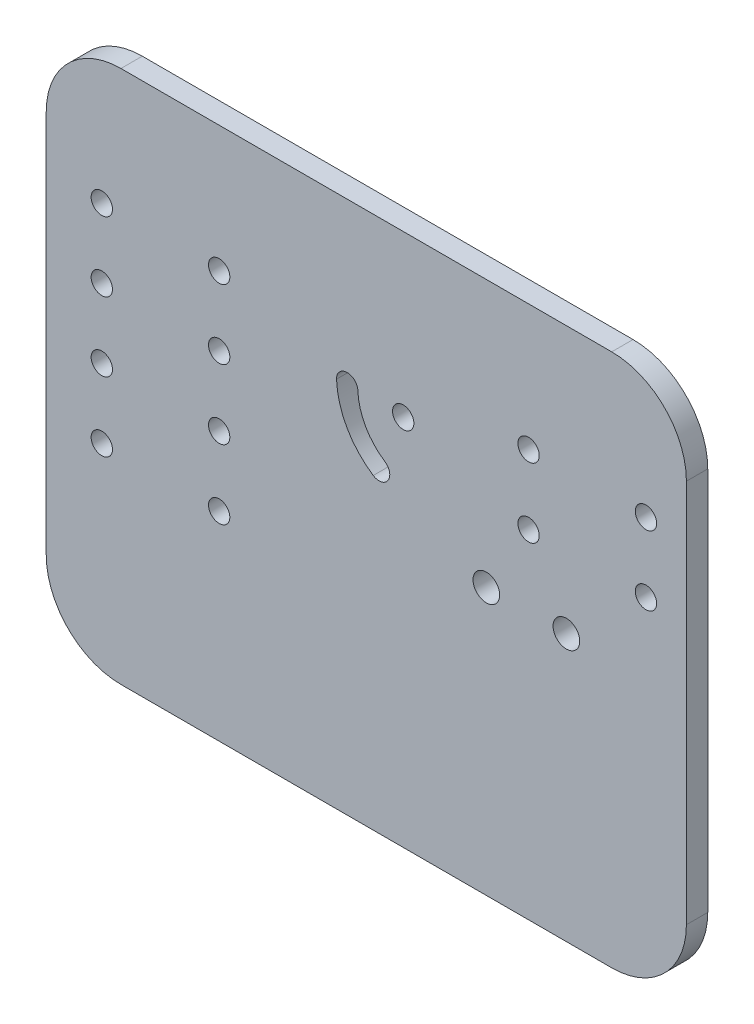
ISO-10303-21;
HEADER;
FILE_DESCRIPTION(('STEP AP214'),'2;1');
FILE_NAME('part.step','',(''),(''),'','','');
FILE_SCHEMA(('AUTOMOTIVE_DESIGN { 1 0 10303 214 1 1 1 1 }'));
ENDSEC;
DATA;
#1=APPLICATION_CONTEXT('core data for automotive mechanical design processes');
#2=APPLICATION_PROTOCOL_DEFINITION('international standard','automotive_design',2000,#1);
#3=PRODUCT_CONTEXT('',#1,'mechanical');
#4=PRODUCT('Part','Part','',(#3));
#5=PRODUCT_RELATED_PRODUCT_CATEGORY('part','',(#4));
#6=PRODUCT_DEFINITION_FORMATION('','',#4);
#7=PRODUCT_DEFINITION_CONTEXT('part definition',#1,'design');
#8=PRODUCT_DEFINITION('design','',#6,#7);
#9=PRODUCT_DEFINITION_SHAPE('','',#8);
#10=(LENGTH_UNIT() NAMED_UNIT(*) SI_UNIT(.MILLI.,.METRE.));
#11=(NAMED_UNIT(*) PLANE_ANGLE_UNIT() SI_UNIT($,.RADIAN.));
#12=(NAMED_UNIT(*) SI_UNIT($,.STERADIAN.) SOLID_ANGLE_UNIT());
#13=UNCERTAINTY_MEASURE_WITH_UNIT(LENGTH_MEASURE(1.E-05),#10,'distance_accuracy_value','');
#14=(GEOMETRIC_REPRESENTATION_CONTEXT(3) GLOBAL_UNCERTAINTY_ASSIGNED_CONTEXT((#13)) GLOBAL_UNIT_ASSIGNED_CONTEXT((#10,
#11,#12)) REPRESENTATION_CONTEXT('',''));
#15=CARTESIAN_POINT('',(0.,0.,0.));
#16=DIRECTION('',(0.,0.,1.));
#17=DIRECTION('',(1.,0.,0.));
#18=AXIS2_PLACEMENT_3D('',#15,#16,#17);
#19=CARTESIAN_POINT('',(-52.655601659751,38.8381742738589,4.));
#20=DIRECTION('',(1.,0.,0.));
#21=DIRECTION('',(0.,1.,0.));
#22=AXIS2_PLACEMENT_3D('',#19,#20,#21);
#23=PLANE('',#22);
#24=DIRECTION('',(0.,-1.,0.));
#25=VECTOR('',#24,1.);
#26=CARTESIAN_POINT('',(-52.655601659751,38.8381742738589,0.));
#27=LINE('',#26,#25);
#28=CARTESIAN_POINT('',(-52.655601659751,24.8381742738589,0.));
#29=VERTEX_POINT('',#28);
#30=CARTESIAN_POINT('',(-52.655601659751,-47.1618257261411,0.));
#31=VERTEX_POINT('',#30);
#32=EDGE_CURVE('E189',#29,#31,#27,.T.);
#33=ORIENTED_EDGE('',*,*,#32,.T.);
#34=DIRECTION('',(0.,0.,-1.));
#35=VECTOR('',#34,1.);
#36=CARTESIAN_POINT('',(-52.655601659751,-47.1618257261411,4.));
#37=LINE('',#36,#35);
#38=CARTESIAN_POINT('',(-52.655601659751,-47.1618257261411,4.));
#39=VERTEX_POINT('',#38);
#40=EDGE_CURVE('E11',#31,#39,#37,.F.);
#41=ORIENTED_EDGE('',*,*,#40,.T.);
#42=DIRECTION('',(0.,-1.,0.));
#43=VECTOR('',#42,1.);
#44=CARTESIAN_POINT('',(-52.655601659751,38.8381742738589,4.));
#45=LINE('',#44,#43);
#46=CARTESIAN_POINT('',(-52.655601659751,24.8381742738589,4.));
#47=VERTEX_POINT('',#46);
#48=EDGE_CURVE('E201',#47,#39,#45,.T.);
#49=ORIENTED_EDGE('',*,*,#48,.F.);
#50=DIRECTION('',(0.,0.,-1.));
#51=VECTOR('',#50,1.);
#52=CARTESIAN_POINT('',(-52.655601659751,24.8381742738589,4.));
#53=LINE('',#52,#51);
#54=EDGE_CURVE('E52',#47,#29,#53,.T.);
#55=ORIENTED_EDGE('',*,*,#54,.T.);
#56=EDGE_LOOP('',(#33,#41,#49,#55));
#57=FACE_BOUND('',#56,.T.);
#58=ADVANCED_FACE('F43',(#57),#23,.F.);
#59=CARTESIAN_POINT('',(-52.655601659751,-61.1618257261411,4.));
#60=DIRECTION('',(0.,1.,0.));
#61=DIRECTION('',(0.,0.,1.));
#62=AXIS2_PLACEMENT_3D('',#59,#60,#61);
#63=PLANE('',#62);
#64=DIRECTION('',(1.,0.,0.));
#65=VECTOR('',#64,1.);
#66=CARTESIAN_POINT('',(-52.655601659751,-61.1618257261411,0.));
#67=LINE('',#66,#65);
#68=CARTESIAN_POINT('',(-38.655601659751,-61.1618257261411,0.));
#69=VERTEX_POINT('',#68);
#70=CARTESIAN_POINT('',(53.3443983402489,-61.1618257261411,0.));
#71=VERTEX_POINT('',#70);
#72=EDGE_CURVE('E222',#69,#71,#67,.T.);
#73=ORIENTED_EDGE('',*,*,#72,.T.);
#74=DIRECTION('',(0.,0.,-1.));
#75=VECTOR('',#74,1.);
#76=CARTESIAN_POINT('',(53.344398340249,-61.1618257261411,4.));
#77=LINE('',#76,#75);
#78=CARTESIAN_POINT('',(53.3443983402489,-61.1618257261411,4.));
#79=VERTEX_POINT('',#78);
#80=EDGE_CURVE('E274',#71,#79,#77,.F.);
#81=ORIENTED_EDGE('',*,*,#80,.T.);
#82=DIRECTION('',(1.,0.,0.));
#83=VECTOR('',#82,1.);
#84=CARTESIAN_POINT('',(-52.655601659751,-61.1618257261411,4.));
#85=LINE('',#84,#83);
#86=CARTESIAN_POINT('',(-38.655601659751,-61.1618257261411,4.));
#87=VERTEX_POINT('',#86);
#88=EDGE_CURVE('E205',#87,#79,#85,.T.);
#89=ORIENTED_EDGE('',*,*,#88,.F.);
#90=DIRECTION('',(0.,0.,-1.));
#91=VECTOR('',#90,1.);
#92=CARTESIAN_POINT('',(-38.655601659751,-61.1618257261411,4.));
#93=LINE('',#92,#91);
#94=EDGE_CURVE('E270',#87,#69,#93,.T.);
#95=ORIENTED_EDGE('',*,*,#94,.T.);
#96=EDGE_LOOP('',(#73,#81,#89,#95));
#97=FACE_BOUND('',#96,.T.);
#98=ADVANCED_FACE('F295',(#97),#63,.F.);
#99=CARTESIAN_POINT('',(67.344398340249,38.8381742738589,4.));
#100=DIRECTION('',(-1.,0.,0.));
#101=DIRECTION('',(0.,0.,1.));
#102=AXIS2_PLACEMENT_3D('',#99,#100,#101);
#103=PLANE('',#102);
#104=DIRECTION('',(0.,1.,0.));
#105=VECTOR('',#104,1.);
#106=CARTESIAN_POINT('',(67.344398340249,38.8381742738589,0.));
#107=LINE('',#106,#105);
#108=CARTESIAN_POINT('',(67.344398340249,-47.1618257261411,0.));
#109=VERTEX_POINT('',#108);
#110=CARTESIAN_POINT('',(67.344398340249,24.8381742738589,0.));
#111=VERTEX_POINT('',#110);
#112=EDGE_CURVE('E226',#109,#111,#107,.T.);
#113=ORIENTED_EDGE('',*,*,#112,.T.);
#114=DIRECTION('',(0.,0.,-1.));
#115=VECTOR('',#114,1.);
#116=CARTESIAN_POINT('',(67.344398340249,24.8381742738589,4.));
#117=LINE('',#116,#115);
#118=CARTESIAN_POINT('',(67.344398340249,24.8381742738589,4.));
#119=VERTEX_POINT('',#118);
#120=EDGE_CURVE('E255',#111,#119,#117,.F.);
#121=ORIENTED_EDGE('',*,*,#120,.T.);
#122=DIRECTION('',(0.,1.,0.));
#123=VECTOR('',#122,1.);
#124=CARTESIAN_POINT('',(67.344398340249,38.8381742738589,4.));
#125=LINE('',#124,#123);
#126=CARTESIAN_POINT('',(67.344398340249,-47.1618257261411,4.));
#127=VERTEX_POINT('',#126);
#128=EDGE_CURVE('E210',#127,#119,#125,.T.);
#129=ORIENTED_EDGE('',*,*,#128,.F.);
#130=DIRECTION('',(0.,0.,-1.));
#131=VECTOR('',#130,1.);
#132=CARTESIAN_POINT('',(67.344398340249,-47.1618257261411,4.));
#133=LINE('',#132,#131);
#134=EDGE_CURVE('E251',#127,#109,#133,.T.);
#135=ORIENTED_EDGE('',*,*,#134,.T.);
#136=EDGE_LOOP('',(#113,#121,#129,#135));
#137=FACE_BOUND('',#136,.T.);
#138=ADVANCED_FACE('F305',(#137),#103,.F.);
#139=CARTESIAN_POINT('',(-52.655601659751,38.8381742738589,4.));
#140=DIRECTION('',(0.,-1.,0.));
#141=DIRECTION('',(0.,0.,-1.));
#142=AXIS2_PLACEMENT_3D('',#139,#140,#141);
#143=PLANE('',#142);
#144=DIRECTION('',(-1.,0.,0.));
#145=VECTOR('',#144,1.);
#146=CARTESIAN_POINT('',(-52.655601659751,38.8381742738589,4.));
#147=LINE('',#146,#145);
#148=CARTESIAN_POINT('',(53.344398340249,38.8381742738589,4.));
#149=VERTEX_POINT('',#148);
#150=CARTESIAN_POINT('',(-38.655601659751,38.8381742738589,4.));
#151=VERTEX_POINT('',#150);
#152=EDGE_CURVE('E214',#149,#151,#147,.T.);
#153=ORIENTED_EDGE('',*,*,#152,.F.);
#154=DIRECTION('',(0.,0.,-1.));
#155=VECTOR('',#154,1.);
#156=CARTESIAN_POINT('',(53.344398340249,38.8381742738589,4.));
#157=LINE('',#156,#155);
#158=CARTESIAN_POINT('',(53.344398340249,38.8381742738589,0.));
#159=VERTEX_POINT('',#158);
#160=EDGE_CURVE('E235',#149,#159,#157,.T.);
#161=ORIENTED_EDGE('',*,*,#160,.T.);
#162=DIRECTION('',(-1.,0.,0.));
#163=VECTOR('',#162,1.);
#164=CARTESIAN_POINT('',(-52.655601659751,38.8381742738589,0.));
#165=LINE('',#164,#163);
#166=CARTESIAN_POINT('',(-38.655601659751,38.8381742738589,0.));
#167=VERTEX_POINT('',#166);
#168=EDGE_CURVE('E206',#159,#167,#165,.T.);
#169=ORIENTED_EDGE('',*,*,#168,.T.);
#170=DIRECTION('',(0.,0.,-1.));
#171=VECTOR('',#170,1.);
#172=CARTESIAN_POINT('',(-38.655601659751,38.8381742738589,4.));
#173=LINE('',#172,#171);
#174=EDGE_CURVE('E218',#167,#151,#173,.F.);
#175=ORIENTED_EDGE('',*,*,#174,.T.);
#176=EDGE_LOOP('',(#153,#161,#169,#175));
#177=FACE_BOUND('',#176,.T.);
#178=ADVANCED_FACE('F313',(#177),#143,.F.);
#179=CARTESIAN_POINT('',(0.,0.,4.));
#180=DIRECTION('',(0.,0.,1.));
#181=DIRECTION('',(1.,0.,0.));
#182=AXIS2_PLACEMENT_3D('',#179,#180,#181);
#183=PLANE('',#182);
#184=CARTESIAN_POINT('',(14.2590681390147,8.6841517624812,4.));
#185=DIRECTION('',(0.,0.,-1.));
#186=DIRECTION('',(-1.,0.,0.));
#187=AXIS2_PLACEMENT_3D('',#184,#185,#186);
#188=CIRCLE('',#187,2.);
#189=CARTESIAN_POINT('',(12.2590681390147,8.6841517624812,4.));
#190=VERTEX_POINT('',#189);
#191=EDGE_CURVE('E641',#190,#190,#188,.T.);
#192=ORIENTED_EDGE('',*,*,#191,.T.);
#193=EDGE_LOOP('',(#192));
#194=FACE_BOUND('',#193,.T.);
#195=CARTESIAN_POINT('',(37.7590681390147,2.18415176248123,4.));
#196=DIRECTION('',(0.,0.,-1.));
#197=DIRECTION('',(-1.,0.,0.));
#198=AXIS2_PLACEMENT_3D('',#195,#196,#197);
#199=CIRCLE('',#198,2.);
#200=CARTESIAN_POINT('',(35.7590681390147,2.18415176248123,4.));
#201=VERTEX_POINT('',#200);
#202=EDGE_CURVE('E662',#201,#201,#199,.T.);
#203=ORIENTED_EDGE('',*,*,#202,.T.);
#204=EDGE_LOOP('',(#203));
#205=FACE_BOUND('',#204,.T.);
#206=CARTESIAN_POINT('',(59.7590681390147,2.18415176248123,4.));
#207=DIRECTION('',(0.,0.,-1.));
#208=DIRECTION('',(-1.,0.,0.));
#209=AXIS2_PLACEMENT_3D('',#206,#207,#208);
#210=CIRCLE('',#209,2.);
#211=CARTESIAN_POINT('',(57.7590681390147,2.18415176248123,4.));
#212=VERTEX_POINT('',#211);
#213=EDGE_CURVE('E670',#212,#212,#210,.T.);
#214=ORIENTED_EDGE('',*,*,#213,.T.);
#215=EDGE_LOOP('',(#214));
#216=FACE_BOUND('',#215,.T.);
#217=CARTESIAN_POINT('',(59.7590681390147,15.1841517624812,4.));
#218=DIRECTION('',(0.,0.,-1.));
#219=DIRECTION('',(-1.,0.,0.));
#220=AXIS2_PLACEMENT_3D('',#217,#218,#219);
#221=CIRCLE('',#220,2.);
#222=CARTESIAN_POINT('',(57.7590681390147,15.1841517624812,4.));
#223=VERTEX_POINT('',#222);
#224=EDGE_CURVE('E160',#223,#223,#221,.T.);
#225=ORIENTED_EDGE('',*,*,#224,.T.);
#226=EDGE_LOOP('',(#225));
#227=FACE_BOUND('',#226,.T.);
#228=CARTESIAN_POINT('',(37.7590681390147,15.1841517624812,4.));
#229=DIRECTION('',(0.,0.,-1.));
#230=DIRECTION('',(-1.,0.,0.));
#231=AXIS2_PLACEMENT_3D('',#228,#229,#230);
#232=CIRCLE('',#231,2.);
#233=CARTESIAN_POINT('',(35.7590681390147,15.1841517624812,4.));
#234=VERTEX_POINT('',#233);
#235=EDGE_CURVE('E656',#234,#234,#232,.T.);
#236=ORIENTED_EDGE('',*,*,#235,.T.);
#237=EDGE_LOOP('',(#236));
#238=FACE_BOUND('',#237,.T.);
#239=CARTESIAN_POINT('',(-20.2409318609853,15.1841517624812,4.));
#240=DIRECTION('',(0.,0.,-1.));
#241=DIRECTION('',(-1.,0.,0.));
#242=AXIS2_PLACEMENT_3D('',#239,#240,#241);
#243=CIRCLE('',#242,2.);
#244=CARTESIAN_POINT('',(-22.2409318609853,15.1841517624812,4.));
#245=VERTEX_POINT('',#244);
#246=EDGE_CURVE('E646',#245,#245,#243,.T.);
#247=ORIENTED_EDGE('',*,*,#246,.T.);
#248=EDGE_LOOP('',(#247));
#249=FACE_BOUND('',#248,.T.);
#250=CARTESIAN_POINT('',(-20.2409318609853,2.18415176248123,4.));
#251=DIRECTION('',(0.,0.,-1.));
#252=DIRECTION('',(-1.,0.,0.));
#253=AXIS2_PLACEMENT_3D('',#250,#251,#252);
#254=CIRCLE('',#253,2.);
#255=CARTESIAN_POINT('',(-22.2409318609853,2.18415176248123,4.));
#256=VERTEX_POINT('',#255);
#257=EDGE_CURVE('E693',#256,#256,#254,.T.);
#258=ORIENTED_EDGE('',*,*,#257,.T.);
#259=EDGE_LOOP('',(#258));
#260=FACE_BOUND('',#259,.T.);
#261=CARTESIAN_POINT('',(-42.2409318609853,15.1841517624812,4.));
#262=DIRECTION('',(0.,0.,-1.));
#263=DIRECTION('',(-1.,0.,0.));
#264=AXIS2_PLACEMENT_3D('',#261,#262,#263);
#265=CIRCLE('',#264,2.);
#266=CARTESIAN_POINT('',(-44.2409318609853,15.1841517624812,4.));
#267=VERTEX_POINT('',#266);
#268=EDGE_CURVE('E701',#267,#267,#265,.T.);
#269=ORIENTED_EDGE('',*,*,#268,.T.);
#270=EDGE_LOOP('',(#269));
#271=FACE_BOUND('',#270,.T.);
#272=CARTESIAN_POINT('',(-42.2409318609853,2.18415176248123,4.));
#273=DIRECTION('',(0.,0.,-1.));
#274=DIRECTION('',(-1.,0.,0.));
#275=AXIS2_PLACEMENT_3D('',#272,#273,#274);
#276=CIRCLE('',#275,2.);
#277=CARTESIAN_POINT('',(-44.2409318609853,2.18415176248123,4.));
#278=VERTEX_POINT('',#277);
#279=EDGE_CURVE('E709',#278,#278,#276,.T.);
#280=ORIENTED_EDGE('',*,*,#279,.T.);
#281=EDGE_LOOP('',(#280));
#282=FACE_BOUND('',#281,.T.);
#283=CARTESIAN_POINT('',(-20.2409318609853,-10.8158482375188,4.));
#284=DIRECTION('',(0.,0.,-1.));
#285=DIRECTION('',(-1.,0.,0.));
#286=AXIS2_PLACEMENT_3D('',#283,#284,#285);
#287=CIRCLE('',#286,2.);
#288=CARTESIAN_POINT('',(-22.2409318609853,-10.8158482375188,4.));
#289=VERTEX_POINT('',#288);
#290=EDGE_CURVE('E717',#289,#289,#287,.T.);
#291=ORIENTED_EDGE('',*,*,#290,.T.);
#292=EDGE_LOOP('',(#291));
#293=FACE_BOUND('',#292,.T.);
#294=CARTESIAN_POINT('',(-42.2409318609853,-10.8158482375188,4.));
#295=DIRECTION('',(0.,0.,-1.));
#296=DIRECTION('',(-1.,0.,0.));
#297=AXIS2_PLACEMENT_3D('',#294,#295,#296);
#298=CIRCLE('',#297,2.);
#299=CARTESIAN_POINT('',(-44.2409318609853,-10.8158482375188,4.));
#300=VERTEX_POINT('',#299);
#301=EDGE_CURVE('E725',#300,#300,#298,.T.);
#302=ORIENTED_EDGE('',*,*,#301,.T.);
#303=EDGE_LOOP('',(#302));
#304=FACE_BOUND('',#303,.T.);
#305=CARTESIAN_POINT('',(-20.2409318609853,-23.8158482375188,4.));
#306=DIRECTION('',(0.,0.,-1.));
#307=DIRECTION('',(-1.,0.,0.));
#308=AXIS2_PLACEMENT_3D('',#305,#306,#307);
#309=CIRCLE('',#308,2.);
#310=CARTESIAN_POINT('',(-22.2409318609853,-23.8158482375188,4.));
#311=VERTEX_POINT('',#310);
#312=EDGE_CURVE('E733',#311,#311,#309,.T.);
#313=ORIENTED_EDGE('',*,*,#312,.T.);
#314=EDGE_LOOP('',(#313));
#315=FACE_BOUND('',#314,.T.);
#316=CARTESIAN_POINT('',(-42.2409318609853,-23.8158482375188,4.));
#317=DIRECTION('',(0.,0.,-1.));
#318=DIRECTION('',(-1.,0.,0.));
#319=AXIS2_PLACEMENT_3D('',#316,#317,#318);
#320=CIRCLE('',#319,2.);
#321=CARTESIAN_POINT('',(-44.2409318609853,-23.8158482375188,4.));
#322=VERTEX_POINT('',#321);
#323=EDGE_CURVE('E741',#322,#322,#320,.T.);
#324=ORIENTED_EDGE('',*,*,#323,.T.);
#325=EDGE_LOOP('',(#324));
#326=FACE_BOUND('',#325,.T.);
#327=CARTESIAN_POINT('',(17.0126483654714,9.17927691726308,4.));
#328=DIRECTION('',(0.,0.,-1.));
#329=DIRECTION('',(-1.,0.,0.));
#330=AXIS2_PLACEMENT_3D('',#327,#328,#329);
#331=CIRCLE('',#330,15.262825405547);
#332=CARTESIAN_POINT('',(8.64092687516701,-3.58270250009164,4.));
#333=VERTEX_POINT('',#332);
#334=CARTESIAN_POINT('',(1.76046228827136,8.60948816107772,4.));
#335=VERTEX_POINT('',#334);
#336=EDGE_CURVE('E134',#333,#335,#331,.T.);
#337=ORIENTED_EDGE('',*,*,#336,.T.);
#338=CARTESIAN_POINT('',(3.75906813901469,8.68415176248119,4.));
#339=DIRECTION('',(0.,0.,-1.));
#340=DIRECTION('',(-1.,0.,0.));
#341=AXIS2_PLACEMENT_3D('',#338,#339,#340);
#342=CIRCLE('',#341,2.);
#343=CARTESIAN_POINT('',(5.75767398975802,8.75881536388469,4.));
#344=VERTEX_POINT('',#343);
#345=EDGE_CURVE('E144',#335,#344,#342,.T.);
#346=ORIENTED_EDGE('',*,*,#345,.T.);
#347=CARTESIAN_POINT('',(17.0126483654714,9.17927691726308,4.));
#348=DIRECTION('',(0.,0.,1.));
#349=DIRECTION('',(-1.,0.,0.));
#350=AXIS2_PLACEMENT_3D('',#347,#348,#349);
#351=CIRCLE('',#350,11.262825405547);
#352=CARTESIAN_POINT('',(10.8349430596834,-0.238110898403884,4.));
#353=VERTEX_POINT('',#352);
#354=EDGE_CURVE('E59',#344,#353,#351,.T.);
#355=ORIENTED_EDGE('',*,*,#354,.T.);
#356=CARTESIAN_POINT('',(9.73793496742518,-1.91040669924776,4.));
#357=DIRECTION('',(0.,0.,-1.));
#358=DIRECTION('',(-1.,0.,0.));
#359=AXIS2_PLACEMENT_3D('',#356,#357,#358);
#360=CIRCLE('',#359,2.);
#361=EDGE_CURVE('E141',#353,#333,#360,.T.);
#362=ORIENTED_EDGE('',*,*,#361,.T.);
#363=EDGE_LOOP('',(#337,#346,#355,#362));
#364=FACE_BOUND('',#363,.T.);
#365=CARTESIAN_POINT('',(44.844398340249,-11.1618257261411,4.));
#366=DIRECTION('',(0.,0.,-1.));
#367=DIRECTION('',(-1.,0.,0.));
#368=AXIS2_PLACEMENT_3D('',#365,#366,#367);
#369=CIRCLE('',#368,2.5);
#370=CARTESIAN_POINT('',(42.344398340249,-11.1618257261411,4.));
#371=VERTEX_POINT('',#370);
#372=EDGE_CURVE('E185',#371,#371,#369,.T.);
#373=ORIENTED_EDGE('',*,*,#372,.T.);
#374=EDGE_LOOP('',(#373));
#375=FACE_BOUND('',#374,.T.);
#376=CARTESIAN_POINT('',(29.844398340249,-11.1618257261411,4.));
#377=DIRECTION('',(0.,0.,-1.));
#378=DIRECTION('',(-1.,0.,0.));
#379=AXIS2_PLACEMENT_3D('',#376,#377,#378);
#380=CIRCLE('',#379,2.5);
#381=CARTESIAN_POINT('',(27.344398340249,-11.1618257261411,4.));
#382=VERTEX_POINT('',#381);
#383=EDGE_CURVE('E179',#382,#382,#380,.T.);
#384=ORIENTED_EDGE('',*,*,#383,.T.);
#385=EDGE_LOOP('',(#384));
#386=FACE_BOUND('',#385,.T.);
#387=ORIENTED_EDGE('',*,*,#128,.T.);
#388=CARTESIAN_POINT('',(53.344398340249,24.8381742738589,4.));
#389=DIRECTION('',(0.,0.,1.));
#390=DIRECTION('',(1.,0.,0.));
#391=AXIS2_PLACEMENT_3D('',#388,#389,#390);
#392=CIRCLE('',#391,14.);
#393=EDGE_CURVE('E267',#119,#149,#392,.T.);
#394=ORIENTED_EDGE('',*,*,#393,.T.);
#395=ORIENTED_EDGE('',*,*,#152,.T.);
#396=CARTESIAN_POINT('',(-38.655601659751,24.8381742738589,4.));
#397=DIRECTION('',(0.,0.,1.));
#398=DIRECTION('',(1.,0.,0.));
#399=AXIS2_PLACEMENT_3D('',#396,#397,#398);
#400=CIRCLE('',#399,14.);
#401=EDGE_CURVE('E258',#151,#47,#400,.T.);
#402=ORIENTED_EDGE('',*,*,#401,.T.);
#403=ORIENTED_EDGE('',*,*,#48,.T.);
#404=CARTESIAN_POINT('',(-38.655601659751,-47.1618257261411,4.));
#405=DIRECTION('',(0.,0.,1.));
#406=DIRECTION('',(1.,0.,0.));
#407=AXIS2_PLACEMENT_3D('',#404,#405,#406);
#408=CIRCLE('',#407,14.);
#409=EDGE_CURVE('E261',#39,#87,#408,.T.);
#410=ORIENTED_EDGE('',*,*,#409,.T.);
#411=ORIENTED_EDGE('',*,*,#88,.T.);
#412=CARTESIAN_POINT('',(53.344398340249,-47.1618257261411,4.));
#413=DIRECTION('',(0.,0.,1.));
#414=DIRECTION('',(1.,0.,0.));
#415=AXIS2_PLACEMENT_3D('',#412,#413,#414);
#416=CIRCLE('',#415,14.);
#417=EDGE_CURVE('E264',#79,#127,#416,.T.);
#418=ORIENTED_EDGE('',*,*,#417,.T.);
#419=EDGE_LOOP('',(#387,#394,#395,#402,#403,#410,#411,#418));
#420=FACE_BOUND('',#419,.T.);
#421=ADVANCED_FACE('F149',(#194,#205,#216,#227,#238,#249,#260,#271,#282,#293,#304,#315,#326,
#364,#375,#386,#420),#183,.T.);
#422=CARTESIAN_POINT('',(0.,0.,0.));
#423=DIRECTION('',(0.,0.,1.));
#424=DIRECTION('',(1.,0.,0.));
#425=AXIS2_PLACEMENT_3D('',#422,#423,#424);
#426=PLANE('',#425);
#427=CARTESIAN_POINT('',(14.2590681390147,8.6841517624812,0.));
#428=DIRECTION('',(0.,0.,-1.));
#429=DIRECTION('',(-1.,0.,0.));
#430=AXIS2_PLACEMENT_3D('',#427,#428,#429);
#431=CIRCLE('',#430,2.);
#432=CARTESIAN_POINT('',(12.2590681390147,8.6841517624812,0.));
#433=VERTEX_POINT('',#432);
#434=EDGE_CURVE('E644',#433,#433,#431,.T.);
#435=ORIENTED_EDGE('',*,*,#434,.F.);
#436=EDGE_LOOP('',(#435));
#437=FACE_BOUND('',#436,.T.);
#438=CARTESIAN_POINT('',(37.7590681390147,2.18415176248123,0.));
#439=DIRECTION('',(0.,0.,-1.));
#440=DIRECTION('',(-1.,0.,0.));
#441=AXIS2_PLACEMENT_3D('',#438,#439,#440);
#442=CIRCLE('',#441,2.);
#443=CARTESIAN_POINT('',(35.7590681390147,2.18415176248123,0.));
#444=VERTEX_POINT('',#443);
#445=EDGE_CURVE('E653',#444,#444,#442,.T.);
#446=ORIENTED_EDGE('',*,*,#445,.F.);
#447=EDGE_LOOP('',(#446));
#448=FACE_BOUND('',#447,.T.);
#449=CARTESIAN_POINT('',(59.7590681390147,2.18415176248123,0.));
#450=DIRECTION('',(0.,0.,-1.));
#451=DIRECTION('',(-1.,0.,0.));
#452=AXIS2_PLACEMENT_3D('',#449,#450,#451);
#453=CIRCLE('',#452,2.);
#454=CARTESIAN_POINT('',(57.7590681390147,2.18415176248123,0.));
#455=VERTEX_POINT('',#454);
#456=EDGE_CURVE('E666',#455,#455,#453,.T.);
#457=ORIENTED_EDGE('',*,*,#456,.F.);
#458=EDGE_LOOP('',(#457));
#459=FACE_BOUND('',#458,.T.);
#460=CARTESIAN_POINT('',(59.7590681390147,15.1841517624812,0.));
#461=DIRECTION('',(0.,0.,-1.));
#462=DIRECTION('',(-1.,0.,0.));
#463=AXIS2_PLACEMENT_3D('',#460,#461,#462);
#464=CIRCLE('',#463,2.);
#465=CARTESIAN_POINT('',(57.7590681390147,15.1841517624812,0.));
#466=VERTEX_POINT('',#465);
#467=EDGE_CURVE('E673',#466,#466,#464,.T.);
#468=ORIENTED_EDGE('',*,*,#467,.F.);
#469=EDGE_LOOP('',(#468));
#470=FACE_BOUND('',#469,.T.);
#471=CARTESIAN_POINT('',(37.7590681390147,15.1841517624812,0.));
#472=DIRECTION('',(0.,0.,-1.));
#473=DIRECTION('',(-1.,0.,0.));
#474=AXIS2_PLACEMENT_3D('',#471,#472,#473);
#475=CIRCLE('',#474,2.);
#476=CARTESIAN_POINT('',(35.7590681390147,15.1841517624812,0.));
#477=VERTEX_POINT('',#476);
#478=EDGE_CURVE('E680',#477,#477,#475,.T.);
#479=ORIENTED_EDGE('',*,*,#478,.F.);
#480=EDGE_LOOP('',(#479));
#481=FACE_BOUND('',#480,.T.);
#482=CARTESIAN_POINT('',(-20.2409318609853,15.1841517624812,0.));
#483=DIRECTION('',(0.,0.,-1.));
#484=DIRECTION('',(-1.,0.,0.));
#485=AXIS2_PLACEMENT_3D('',#482,#483,#484);
#486=CIRCLE('',#485,2.);
#487=CARTESIAN_POINT('',(-22.2409318609853,15.1841517624812,0.));
#488=VERTEX_POINT('',#487);
#489=EDGE_CURVE('E651',#488,#488,#486,.T.);
#490=ORIENTED_EDGE('',*,*,#489,.F.);
#491=EDGE_LOOP('',(#490));
#492=FACE_BOUND('',#491,.T.);
#493=CARTESIAN_POINT('',(-20.2409318609853,2.18415176248123,0.));
#494=DIRECTION('',(0.,0.,-1.));
#495=DIRECTION('',(-1.,0.,0.));
#496=AXIS2_PLACEMENT_3D('',#493,#494,#495);
#497=CIRCLE('',#496,2.);
#498=CARTESIAN_POINT('',(-22.2409318609853,2.18415176248123,0.));
#499=VERTEX_POINT('',#498);
#500=EDGE_CURVE('E697',#499,#499,#497,.T.);
#501=ORIENTED_EDGE('',*,*,#500,.F.);
#502=EDGE_LOOP('',(#501));
#503=FACE_BOUND('',#502,.T.);
#504=CARTESIAN_POINT('',(-42.2409318609853,15.1841517624812,0.));
#505=DIRECTION('',(0.,0.,-1.));
#506=DIRECTION('',(-1.,0.,0.));
#507=AXIS2_PLACEMENT_3D('',#504,#505,#506);
#508=CIRCLE('',#507,2.);
#509=CARTESIAN_POINT('',(-44.2409318609853,15.1841517624812,0.));
#510=VERTEX_POINT('',#509);
#511=EDGE_CURVE('E705',#510,#510,#508,.T.);
#512=ORIENTED_EDGE('',*,*,#511,.F.);
#513=EDGE_LOOP('',(#512));
#514=FACE_BOUND('',#513,.T.);
#515=CARTESIAN_POINT('',(-42.2409318609853,2.18415176248123,0.));
#516=DIRECTION('',(0.,0.,-1.));
#517=DIRECTION('',(-1.,0.,0.));
#518=AXIS2_PLACEMENT_3D('',#515,#516,#517);
#519=CIRCLE('',#518,2.);
#520=CARTESIAN_POINT('',(-44.2409318609853,2.18415176248123,0.));
#521=VERTEX_POINT('',#520);
#522=EDGE_CURVE('E713',#521,#521,#519,.T.);
#523=ORIENTED_EDGE('',*,*,#522,.F.);
#524=EDGE_LOOP('',(#523));
#525=FACE_BOUND('',#524,.T.);
#526=CARTESIAN_POINT('',(-20.2409318609853,-10.8158482375188,0.));
#527=DIRECTION('',(0.,0.,-1.));
#528=DIRECTION('',(-1.,0.,0.));
#529=AXIS2_PLACEMENT_3D('',#526,#527,#528);
#530=CIRCLE('',#529,2.);
#531=CARTESIAN_POINT('',(-22.2409318609853,-10.8158482375188,0.));
#532=VERTEX_POINT('',#531);
#533=EDGE_CURVE('E721',#532,#532,#530,.T.);
#534=ORIENTED_EDGE('',*,*,#533,.F.);
#535=EDGE_LOOP('',(#534));
#536=FACE_BOUND('',#535,.T.);
#537=CARTESIAN_POINT('',(-42.2409318609853,-10.8158482375188,0.));
#538=DIRECTION('',(0.,0.,-1.));
#539=DIRECTION('',(-1.,0.,0.));
#540=AXIS2_PLACEMENT_3D('',#537,#538,#539);
#541=CIRCLE('',#540,2.);
#542=CARTESIAN_POINT('',(-44.2409318609853,-10.8158482375188,0.));
#543=VERTEX_POINT('',#542);
#544=EDGE_CURVE('E729',#543,#543,#541,.T.);
#545=ORIENTED_EDGE('',*,*,#544,.F.);
#546=EDGE_LOOP('',(#545));
#547=FACE_BOUND('',#546,.T.);
#548=CARTESIAN_POINT('',(-20.2409318609853,-23.8158482375188,0.));
#549=DIRECTION('',(0.,0.,-1.));
#550=DIRECTION('',(-1.,0.,0.));
#551=AXIS2_PLACEMENT_3D('',#548,#549,#550);
#552=CIRCLE('',#551,2.);
#553=CARTESIAN_POINT('',(-22.2409318609853,-23.8158482375188,0.));
#554=VERTEX_POINT('',#553);
#555=EDGE_CURVE('E737',#554,#554,#552,.T.);
#556=ORIENTED_EDGE('',*,*,#555,.F.);
#557=EDGE_LOOP('',(#556));
#558=FACE_BOUND('',#557,.T.);
#559=CARTESIAN_POINT('',(-42.2409318609853,-23.8158482375188,0.));
#560=DIRECTION('',(0.,0.,-1.));
#561=DIRECTION('',(-1.,0.,0.));
#562=AXIS2_PLACEMENT_3D('',#559,#560,#561);
#563=CIRCLE('',#562,2.);
#564=CARTESIAN_POINT('',(-44.2409318609853,-23.8158482375188,0.));
#565=VERTEX_POINT('',#564);
#566=EDGE_CURVE('E170',#565,#565,#563,.T.);
#567=ORIENTED_EDGE('',*,*,#566,.F.);
#568=EDGE_LOOP('',(#567));
#569=FACE_BOUND('',#568,.T.);
#570=CARTESIAN_POINT('',(3.75906813901469,8.68415176248119,0.));
#571=DIRECTION('',(0.,0.,-1.));
#572=DIRECTION('',(-1.,0.,0.));
#573=AXIS2_PLACEMENT_3D('',#570,#571,#572);
#574=CIRCLE('',#573,2.);
#575=CARTESIAN_POINT('',(1.76046228827136,8.60948816107772,0.));
#576=VERTEX_POINT('',#575);
#577=CARTESIAN_POINT('',(5.75767398975802,8.75881536388469,0.));
#578=VERTEX_POINT('',#577);
#579=EDGE_CURVE('E169',#576,#578,#574,.T.);
#580=ORIENTED_EDGE('',*,*,#579,.F.);
#581=CARTESIAN_POINT('',(17.0126483654714,9.17927691726308,0.));
#582=DIRECTION('',(0.,0.,-1.));
#583=DIRECTION('',(-1.,0.,0.));
#584=AXIS2_PLACEMENT_3D('',#581,#582,#583);
#585=CIRCLE('',#584,15.262825405547);
#586=CARTESIAN_POINT('',(8.64092687516701,-3.58270250009164,0.));
#587=VERTEX_POINT('',#586);
#588=EDGE_CURVE('E67',#587,#576,#585,.T.);
#589=ORIENTED_EDGE('',*,*,#588,.F.);
#590=CARTESIAN_POINT('',(9.73793496742518,-1.91040669924776,0.));
#591=DIRECTION('',(0.,0.,-1.));
#592=DIRECTION('',(-1.,0.,0.));
#593=AXIS2_PLACEMENT_3D('',#590,#591,#592);
#594=CIRCLE('',#593,2.);
#595=CARTESIAN_POINT('',(10.8349430596834,-0.238110898403884,0.));
#596=VERTEX_POINT('',#595);
#597=EDGE_CURVE('E153',#596,#587,#594,.T.);
#598=ORIENTED_EDGE('',*,*,#597,.F.);
#599=CARTESIAN_POINT('',(17.0126483654714,9.17927691726308,0.));
#600=DIRECTION('',(0.,0.,1.));
#601=DIRECTION('',(-1.,0.,0.));
#602=AXIS2_PLACEMENT_3D('',#599,#600,#601);
#603=CIRCLE('',#602,11.262825405547);
#604=EDGE_CURVE('E157',#578,#596,#603,.T.);
#605=ORIENTED_EDGE('',*,*,#604,.F.);
#606=EDGE_LOOP('',(#580,#589,#598,#605));
#607=FACE_BOUND('',#606,.T.);
#608=CARTESIAN_POINT('',(44.844398340249,-11.1618257261411,0.));
#609=DIRECTION('',(0.,0.,-1.));
#610=DIRECTION('',(-1.,0.,0.));
#611=AXIS2_PLACEMENT_3D('',#608,#609,#610);
#612=CIRCLE('',#611,2.5);
#613=CARTESIAN_POINT('',(42.344398340249,-11.1618257261411,0.));
#614=VERTEX_POINT('',#613);
#615=EDGE_CURVE('E190',#614,#614,#612,.T.);
#616=ORIENTED_EDGE('',*,*,#615,.F.);
#617=EDGE_LOOP('',(#616));
#618=FACE_BOUND('',#617,.T.);
#619=CARTESIAN_POINT('',(29.844398340249,-11.1618257261411,0.));
#620=DIRECTION('',(0.,0.,-1.));
#621=DIRECTION('',(-1.,0.,0.));
#622=AXIS2_PLACEMENT_3D('',#619,#620,#621);
#623=CIRCLE('',#622,2.5);
#624=CARTESIAN_POINT('',(27.344398340249,-11.1618257261411,0.));
#625=VERTEX_POINT('',#624);
#626=EDGE_CURVE('E194',#625,#625,#623,.T.);
#627=ORIENTED_EDGE('',*,*,#626,.F.);
#628=EDGE_LOOP('',(#627));
#629=FACE_BOUND('',#628,.T.);
#630=ORIENTED_EDGE('',*,*,#168,.F.);
#631=CARTESIAN_POINT('',(53.344398340249,24.8381742738589,0.));
#632=DIRECTION('',(0.,0.,1.));
#633=DIRECTION('',(1.,0.,0.));
#634=AXIS2_PLACEMENT_3D('',#631,#632,#633);
#635=CIRCLE('',#634,14.);
#636=EDGE_CURVE('E248',#159,#111,#635,.F.);
#637=ORIENTED_EDGE('',*,*,#636,.T.);
#638=ORIENTED_EDGE('',*,*,#112,.F.);
#639=CARTESIAN_POINT('',(53.344398340249,-47.1618257261411,0.));
#640=DIRECTION('',(0.,0.,1.));
#641=DIRECTION('',(1.,0.,0.));
#642=AXIS2_PLACEMENT_3D('',#639,#640,#641);
#643=CIRCLE('',#642,14.);
#644=EDGE_CURVE('E245',#109,#71,#643,.F.);
#645=ORIENTED_EDGE('',*,*,#644,.T.);
#646=ORIENTED_EDGE('',*,*,#72,.F.);
#647=CARTESIAN_POINT('',(-38.655601659751,-47.1618257261411,0.));
#648=DIRECTION('',(0.,0.,1.));
#649=DIRECTION('',(1.,0.,0.));
#650=AXIS2_PLACEMENT_3D('',#647,#648,#649);
#651=CIRCLE('',#650,14.);
#652=EDGE_CURVE('E242',#69,#31,#651,.F.);
#653=ORIENTED_EDGE('',*,*,#652,.T.);
#654=ORIENTED_EDGE('',*,*,#32,.F.);
#655=CARTESIAN_POINT('',(-38.655601659751,24.8381742738589,0.));
#656=DIRECTION('',(0.,0.,1.));
#657=DIRECTION('',(1.,0.,0.));
#658=AXIS2_PLACEMENT_3D('',#655,#656,#657);
#659=CIRCLE('',#658,14.);
#660=EDGE_CURVE('E239',#29,#167,#659,.F.);
#661=ORIENTED_EDGE('',*,*,#660,.T.);
#662=EDGE_LOOP('',(#630,#637,#638,#645,#646,#653,#654,#661));
#663=FACE_BOUND('',#662,.T.);
#664=ADVANCED_FACE('F287',(#437,#448,#459,#470,#481,#492,#503,#514,#525,#536,#547,#558,#569,
#607,#618,#629,#663),#426,.F.);
#665=CARTESIAN_POINT('',(53.344398340249,24.8381742738589,4.));
#666=DIRECTION('',(0.,0.,-1.));
#667=DIRECTION('',(-1.,0.,0.));
#668=AXIS2_PLACEMENT_3D('',#665,#666,#667);
#669=CYLINDRICAL_SURFACE('',#668,14.);
#670=ORIENTED_EDGE('',*,*,#393,.F.);
#671=ORIENTED_EDGE('',*,*,#120,.F.);
#672=ORIENTED_EDGE('',*,*,#636,.F.);
#673=ORIENTED_EDGE('',*,*,#160,.F.);
#674=EDGE_LOOP('',(#670,#671,#672,#673));
#675=FACE_BOUND('',#674,.T.);
#676=ADVANCED_FACE('F310',(#675),#669,.T.);
#677=CARTESIAN_POINT('',(53.344398340249,-47.1618257261411,4.));
#678=DIRECTION('',(0.,0.,-1.));
#679=DIRECTION('',(-1.,0.,0.));
#680=AXIS2_PLACEMENT_3D('',#677,#678,#679);
#681=CYLINDRICAL_SURFACE('',#680,14.);
#682=ORIENTED_EDGE('',*,*,#417,.F.);
#683=ORIENTED_EDGE('',*,*,#80,.F.);
#684=ORIENTED_EDGE('',*,*,#644,.F.);
#685=ORIENTED_EDGE('',*,*,#134,.F.);
#686=EDGE_LOOP('',(#682,#683,#684,#685));
#687=FACE_BOUND('',#686,.T.);
#688=ADVANCED_FACE('F302',(#687),#681,.T.);
#689=CARTESIAN_POINT('',(-38.655601659751,-47.1618257261411,4.));
#690=DIRECTION('',(0.,0.,-1.));
#691=DIRECTION('',(-1.,0.,0.));
#692=AXIS2_PLACEMENT_3D('',#689,#690,#691);
#693=CYLINDRICAL_SURFACE('',#692,14.);
#694=ORIENTED_EDGE('',*,*,#409,.F.);
#695=ORIENTED_EDGE('',*,*,#40,.F.);
#696=ORIENTED_EDGE('',*,*,#652,.F.);
#697=ORIENTED_EDGE('',*,*,#94,.F.);
#698=EDGE_LOOP('',(#694,#695,#696,#697));
#699=FACE_BOUND('',#698,.T.);
#700=ADVANCED_FACE('F292',(#699),#693,.T.);
#701=CARTESIAN_POINT('',(-38.655601659751,24.8381742738589,4.));
#702=DIRECTION('',(0.,0.,-1.));
#703=DIRECTION('',(-1.,0.,0.));
#704=AXIS2_PLACEMENT_3D('',#701,#702,#703);
#705=CYLINDRICAL_SURFACE('',#704,14.);
#706=ORIENTED_EDGE('',*,*,#401,.F.);
#707=ORIENTED_EDGE('',*,*,#174,.F.);
#708=ORIENTED_EDGE('',*,*,#660,.F.);
#709=ORIENTED_EDGE('',*,*,#54,.F.);
#710=EDGE_LOOP('',(#706,#707,#708,#709));
#711=FACE_BOUND('',#710,.T.);
#712=ADVANCED_FACE('F45',(#711),#705,.T.);
#713=CARTESIAN_POINT('',(29.844398340249,-11.1618257261411,4.));
#714=DIRECTION('',(0.,0.,-1.));
#715=DIRECTION('',(-1.,0.,0.));
#716=AXIS2_PLACEMENT_3D('',#713,#714,#715);
#717=CYLINDRICAL_SURFACE('',#716,2.5);
#718=ORIENTED_EDGE('',*,*,#383,.F.);
#719=EDGE_LOOP('',(#718));
#720=FACE_BOUND('',#719,.T.);
#721=ORIENTED_EDGE('',*,*,#626,.T.);
#722=EDGE_LOOP('',(#721));
#723=FACE_BOUND('',#722,.T.);
#724=ADVANCED_FACE('F316',(#720,#723),#717,.F.);
#725=CARTESIAN_POINT('',(44.844398340249,-11.1618257261411,4.));
#726=DIRECTION('',(0.,0.,-1.));
#727=DIRECTION('',(-1.,0.,0.));
#728=AXIS2_PLACEMENT_3D('',#725,#726,#727);
#729=CYLINDRICAL_SURFACE('',#728,2.5);
#730=ORIENTED_EDGE('',*,*,#372,.F.);
#731=EDGE_LOOP('',(#730));
#732=FACE_BOUND('',#731,.T.);
#733=ORIENTED_EDGE('',*,*,#615,.T.);
#734=EDGE_LOOP('',(#733));
#735=FACE_BOUND('',#734,.T.);
#736=ADVANCED_FACE('F321',(#732,#735),#729,.F.);
#737=CARTESIAN_POINT('',(17.0126483654714,9.17927691726308,4.));
#738=DIRECTION('',(0.,0.,-1.));
#739=DIRECTION('',(-1.,0.,0.));
#740=AXIS2_PLACEMENT_3D('',#737,#738,#739);
#741=CYLINDRICAL_SURFACE('',#740,15.262825405547);
#742=ORIENTED_EDGE('',*,*,#588,.T.);
#743=DIRECTION('',(0.,0.,-1.));
#744=VECTOR('',#743,1.);
#745=CARTESIAN_POINT('',(1.76046228827136,8.60948816107772,4.));
#746=LINE('',#745,#744);
#747=EDGE_CURVE('E130',#335,#576,#746,.T.);
#748=ORIENTED_EDGE('',*,*,#747,.F.);
#749=ORIENTED_EDGE('',*,*,#336,.F.);
#750=DIRECTION('',(0.,0.,-1.));
#751=VECTOR('',#750,1.);
#752=CARTESIAN_POINT('',(8.64092687516701,-3.58270250009164,4.));
#753=LINE('',#752,#751);
#754=EDGE_CURVE('E176',#333,#587,#753,.T.);
#755=ORIENTED_EDGE('',*,*,#754,.T.);
#756=EDGE_LOOP('',(#742,#748,#749,#755));
#757=FACE_BOUND('',#756,.T.);
#758=ADVANCED_FACE('F132',(#757),#741,.F.);
#759=CARTESIAN_POINT('',(9.73793496742518,-1.91040669924776,4.));
#760=DIRECTION('',(0.,0.,-1.));
#761=DIRECTION('',(-1.,0.,0.));
#762=AXIS2_PLACEMENT_3D('',#759,#760,#761);
#763=CYLINDRICAL_SURFACE('',#762,2.);
#764=ORIENTED_EDGE('',*,*,#597,.T.);
#765=ORIENTED_EDGE('',*,*,#754,.F.);
#766=ORIENTED_EDGE('',*,*,#361,.F.);
#767=DIRECTION('',(0.,0.,-1.));
#768=VECTOR('',#767,1.);
#769=CARTESIAN_POINT('',(10.8349430596834,-0.238110898403884,4.));
#770=LINE('',#769,#768);
#771=EDGE_CURVE('E180',#353,#596,#770,.T.);
#772=ORIENTED_EDGE('',*,*,#771,.T.);
#773=EDGE_LOOP('',(#764,#765,#766,#772));
#774=FACE_BOUND('',#773,.T.);
#775=ADVANCED_FACE('F398',(#774),#763,.F.);
#776=CARTESIAN_POINT('',(17.0126483654714,9.17927691726308,4.));
#777=DIRECTION('',(0.,0.,-1.));
#778=DIRECTION('',(-1.,0.,0.));
#779=AXIS2_PLACEMENT_3D('',#776,#777,#778);
#780=CYLINDRICAL_SURFACE('',#779,11.262825405547);
#781=ORIENTED_EDGE('',*,*,#604,.T.);
#782=ORIENTED_EDGE('',*,*,#771,.F.);
#783=ORIENTED_EDGE('',*,*,#354,.F.);
#784=DIRECTION('',(0.,0.,-1.));
#785=VECTOR('',#784,1.);
#786=CARTESIAN_POINT('',(5.75767398975802,8.75881536388469,4.));
#787=LINE('',#786,#785);
#788=EDGE_CURVE('E140',#344,#578,#787,.T.);
#789=ORIENTED_EDGE('',*,*,#788,.T.);
#790=EDGE_LOOP('',(#781,#782,#783,#789));
#791=FACE_BOUND('',#790,.T.);
#792=ADVANCED_FACE('F408',(#791),#780,.T.);
#793=CARTESIAN_POINT('',(3.75906813901469,8.68415176248119,4.));
#794=DIRECTION('',(0.,0.,-1.));
#795=DIRECTION('',(-1.,0.,0.));
#796=AXIS2_PLACEMENT_3D('',#793,#794,#795);
#797=CYLINDRICAL_SURFACE('',#796,2.);
#798=ORIENTED_EDGE('',*,*,#579,.T.);
#799=ORIENTED_EDGE('',*,*,#788,.F.);
#800=ORIENTED_EDGE('',*,*,#345,.F.);
#801=ORIENTED_EDGE('',*,*,#747,.T.);
#802=EDGE_LOOP('',(#798,#799,#800,#801));
#803=FACE_BOUND('',#802,.T.);
#804=ADVANCED_FACE('F145',(#803),#797,.F.);
#805=CARTESIAN_POINT('',(-42.2409318609853,-23.8158482375188,4.));
#806=DIRECTION('',(0.,0.,-1.));
#807=DIRECTION('',(-1.,0.,0.));
#808=AXIS2_PLACEMENT_3D('',#805,#806,#807);
#809=CYLINDRICAL_SURFACE('',#808,2.);
#810=ORIENTED_EDGE('',*,*,#323,.F.);
#811=EDGE_LOOP('',(#810));
#812=FACE_BOUND('',#811,.T.);
#813=ORIENTED_EDGE('',*,*,#566,.T.);
#814=EDGE_LOOP('',(#813));
#815=FACE_BOUND('',#814,.T.);
#816=ADVANCED_FACE('F428',(#812,#815),#809,.F.);
#817=CARTESIAN_POINT('',(-20.2409318609853,-23.8158482375188,4.));
#818=DIRECTION('',(0.,0.,-1.));
#819=DIRECTION('',(-1.,0.,0.));
#820=AXIS2_PLACEMENT_3D('',#817,#818,#819);
#821=CYLINDRICAL_SURFACE('',#820,2.);
#822=ORIENTED_EDGE('',*,*,#312,.F.);
#823=EDGE_LOOP('',(#822));
#824=FACE_BOUND('',#823,.T.);
#825=ORIENTED_EDGE('',*,*,#555,.T.);
#826=EDGE_LOOP('',(#825));
#827=FACE_BOUND('',#826,.T.);
#828=ADVANCED_FACE('F438',(#824,#827),#821,.F.);
#829=CARTESIAN_POINT('',(-42.2409318609853,-10.8158482375188,4.));
#830=DIRECTION('',(0.,0.,-1.));
#831=DIRECTION('',(-1.,0.,0.));
#832=AXIS2_PLACEMENT_3D('',#829,#830,#831);
#833=CYLINDRICAL_SURFACE('',#832,2.);
#834=ORIENTED_EDGE('',*,*,#301,.F.);
#835=EDGE_LOOP('',(#834));
#836=FACE_BOUND('',#835,.T.);
#837=ORIENTED_EDGE('',*,*,#544,.T.);
#838=EDGE_LOOP('',(#837));
#839=FACE_BOUND('',#838,.T.);
#840=ADVANCED_FACE('F449',(#836,#839),#833,.F.);
#841=CARTESIAN_POINT('',(-20.2409318609853,-10.8158482375188,4.));
#842=DIRECTION('',(0.,0.,-1.));
#843=DIRECTION('',(-1.,0.,0.));
#844=AXIS2_PLACEMENT_3D('',#841,#842,#843);
#845=CYLINDRICAL_SURFACE('',#844,2.);
#846=ORIENTED_EDGE('',*,*,#290,.F.);
#847=EDGE_LOOP('',(#846));
#848=FACE_BOUND('',#847,.T.);
#849=ORIENTED_EDGE('',*,*,#533,.T.);
#850=EDGE_LOOP('',(#849));
#851=FACE_BOUND('',#850,.T.);
#852=ADVANCED_FACE('F460',(#848,#851),#845,.F.);
#853=CARTESIAN_POINT('',(-42.2409318609853,2.18415176248123,4.));
#854=DIRECTION('',(0.,0.,-1.));
#855=DIRECTION('',(-1.,0.,0.));
#856=AXIS2_PLACEMENT_3D('',#853,#854,#855);
#857=CYLINDRICAL_SURFACE('',#856,2.);
#858=ORIENTED_EDGE('',*,*,#279,.F.);
#859=EDGE_LOOP('',(#858));
#860=FACE_BOUND('',#859,.T.);
#861=ORIENTED_EDGE('',*,*,#522,.T.);
#862=EDGE_LOOP('',(#861));
#863=FACE_BOUND('',#862,.T.);
#864=ADVANCED_FACE('F471',(#860,#863),#857,.F.);
#865=CARTESIAN_POINT('',(-42.2409318609853,15.1841517624812,4.));
#866=DIRECTION('',(0.,0.,-1.));
#867=DIRECTION('',(-1.,0.,0.));
#868=AXIS2_PLACEMENT_3D('',#865,#866,#867);
#869=CYLINDRICAL_SURFACE('',#868,2.);
#870=ORIENTED_EDGE('',*,*,#268,.F.);
#871=EDGE_LOOP('',(#870));
#872=FACE_BOUND('',#871,.T.);
#873=ORIENTED_EDGE('',*,*,#511,.T.);
#874=EDGE_LOOP('',(#873));
#875=FACE_BOUND('',#874,.T.);
#876=ADVANCED_FACE('F482',(#872,#875),#869,.F.);
#877=CARTESIAN_POINT('',(-20.2409318609853,2.18415176248123,4.));
#878=DIRECTION('',(0.,0.,-1.));
#879=DIRECTION('',(-1.,0.,0.));
#880=AXIS2_PLACEMENT_3D('',#877,#878,#879);
#881=CYLINDRICAL_SURFACE('',#880,2.);
#882=ORIENTED_EDGE('',*,*,#257,.F.);
#883=EDGE_LOOP('',(#882));
#884=FACE_BOUND('',#883,.T.);
#885=ORIENTED_EDGE('',*,*,#500,.T.);
#886=EDGE_LOOP('',(#885));
#887=FACE_BOUND('',#886,.T.);
#888=ADVANCED_FACE('F493',(#884,#887),#881,.F.);
#889=CARTESIAN_POINT('',(-20.2409318609853,15.1841517624812,4.));
#890=DIRECTION('',(0.,0.,-1.));
#891=DIRECTION('',(-1.,0.,0.));
#892=AXIS2_PLACEMENT_3D('',#889,#890,#891);
#893=CYLINDRICAL_SURFACE('',#892,2.);
#894=ORIENTED_EDGE('',*,*,#246,.F.);
#895=EDGE_LOOP('',(#894));
#896=FACE_BOUND('',#895,.T.);
#897=ORIENTED_EDGE('',*,*,#489,.T.);
#898=EDGE_LOOP('',(#897));
#899=FACE_BOUND('',#898,.T.);
#900=ADVANCED_FACE('F504',(#896,#899),#893,.F.);
#901=CARTESIAN_POINT('',(37.7590681390147,15.1841517624812,4.));
#902=DIRECTION('',(0.,0.,-1.));
#903=DIRECTION('',(-1.,0.,0.));
#904=AXIS2_PLACEMENT_3D('',#901,#902,#903);
#905=CYLINDRICAL_SURFACE('',#904,2.);
#906=ORIENTED_EDGE('',*,*,#235,.F.);
#907=EDGE_LOOP('',(#906));
#908=FACE_BOUND('',#907,.T.);
#909=ORIENTED_EDGE('',*,*,#478,.T.);
#910=EDGE_LOOP('',(#909));
#911=FACE_BOUND('',#910,.T.);
#912=ADVANCED_FACE('F515',(#908,#911),#905,.F.);
#913=CARTESIAN_POINT('',(59.7590681390147,15.1841517624812,4.));
#914=DIRECTION('',(0.,0.,-1.));
#915=DIRECTION('',(-1.,0.,0.));
#916=AXIS2_PLACEMENT_3D('',#913,#914,#915);
#917=CYLINDRICAL_SURFACE('',#916,2.);
#918=ORIENTED_EDGE('',*,*,#224,.F.);
#919=EDGE_LOOP('',(#918));
#920=FACE_BOUND('',#919,.T.);
#921=ORIENTED_EDGE('',*,*,#467,.T.);
#922=EDGE_LOOP('',(#921));
#923=FACE_BOUND('',#922,.T.);
#924=ADVANCED_FACE('F526',(#920,#923),#917,.F.);
#925=CARTESIAN_POINT('',(59.7590681390147,2.18415176248123,4.));
#926=DIRECTION('',(0.,0.,-1.));
#927=DIRECTION('',(-1.,0.,0.));
#928=AXIS2_PLACEMENT_3D('',#925,#926,#927);
#929=CYLINDRICAL_SURFACE('',#928,2.);
#930=ORIENTED_EDGE('',*,*,#213,.F.);
#931=EDGE_LOOP('',(#930));
#932=FACE_BOUND('',#931,.T.);
#933=ORIENTED_EDGE('',*,*,#456,.T.);
#934=EDGE_LOOP('',(#933));
#935=FACE_BOUND('',#934,.T.);
#936=ADVANCED_FACE('F537',(#932,#935),#929,.F.);
#937=CARTESIAN_POINT('',(37.7590681390147,2.18415176248123,4.));
#938=DIRECTION('',(0.,0.,-1.));
#939=DIRECTION('',(-1.,0.,0.));
#940=AXIS2_PLACEMENT_3D('',#937,#938,#939);
#941=CYLINDRICAL_SURFACE('',#940,2.);
#942=ORIENTED_EDGE('',*,*,#202,.F.);
#943=EDGE_LOOP('',(#942));
#944=FACE_BOUND('',#943,.T.);
#945=ORIENTED_EDGE('',*,*,#445,.T.);
#946=EDGE_LOOP('',(#945));
#947=FACE_BOUND('',#946,.T.);
#948=ADVANCED_FACE('F548',(#944,#947),#941,.F.);
#949=CARTESIAN_POINT('',(14.2590681390147,8.6841517624812,4.));
#950=DIRECTION('',(0.,0.,-1.));
#951=DIRECTION('',(-1.,0.,0.));
#952=AXIS2_PLACEMENT_3D('',#949,#950,#951);
#953=CYLINDRICAL_SURFACE('',#952,2.);
#954=ORIENTED_EDGE('',*,*,#191,.F.);
#955=EDGE_LOOP('',(#954));
#956=FACE_BOUND('',#955,.T.);
#957=ORIENTED_EDGE('',*,*,#434,.T.);
#958=EDGE_LOOP('',(#957));
#959=FACE_BOUND('',#958,.T.);
#960=ADVANCED_FACE('F559',(#956,#959),#953,.F.);
#961=CLOSED_SHELL('',(#58,#98,#138,#178,#421,#664,#676,#688,#700,#712,#724,#736,#758,#775,#792,
#804,#816,#828,#840,#852,#864,#876,#888,#900,#912,#924,#936,#948,#960));
#962=MANIFOLD_SOLID_BREP('B2',#961);
#963=ADVANCED_BREP_SHAPE_REPRESENTATION('',(#18,#962),#14);
#964=SHAPE_DEFINITION_REPRESENTATION(#9,#963);
ENDSEC;
END-ISO-10303-21;
